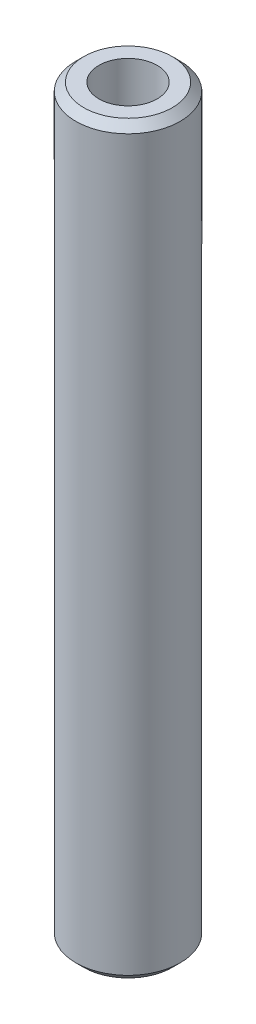
ISO-10303-21;
HEADER;
FILE_DESCRIPTION(('STEP AP214'),'2;1');
FILE_NAME('part.step','',(''),(''),'','','');
FILE_SCHEMA(('AUTOMOTIVE_DESIGN { 1 0 10303 214 1 1 1 1 }'));
ENDSEC;
DATA;
#1=APPLICATION_CONTEXT('core data for automotive mechanical design processes');
#2=APPLICATION_PROTOCOL_DEFINITION('international standard','automotive_design',2000,#1);
#3=PRODUCT_CONTEXT('',#1,'mechanical');
#4=PRODUCT('Part','Part','',(#3));
#5=PRODUCT_RELATED_PRODUCT_CATEGORY('part','',(#4));
#6=PRODUCT_DEFINITION_FORMATION('','',#4);
#7=PRODUCT_DEFINITION_CONTEXT('part definition',#1,'design');
#8=PRODUCT_DEFINITION('design','',#6,#7);
#9=PRODUCT_DEFINITION_SHAPE('','',#8);
#10=(LENGTH_UNIT() NAMED_UNIT(*) SI_UNIT(.MILLI.,.METRE.));
#11=(NAMED_UNIT(*) PLANE_ANGLE_UNIT() SI_UNIT($,.RADIAN.));
#12=(NAMED_UNIT(*) SI_UNIT($,.STERADIAN.) SOLID_ANGLE_UNIT());
#13=UNCERTAINTY_MEASURE_WITH_UNIT(LENGTH_MEASURE(1.E-05),#10,'distance_accuracy_value','');
#14=(GEOMETRIC_REPRESENTATION_CONTEXT(3) GLOBAL_UNCERTAINTY_ASSIGNED_CONTEXT((#13)) GLOBAL_UNIT_ASSIGNED_CONTEXT((#10,
#11,#12)) REPRESENTATION_CONTEXT('',''));
#15=CARTESIAN_POINT('',(0.,0.,0.));
#16=DIRECTION('',(0.,0.,1.));
#17=DIRECTION('',(1.,0.,0.));
#18=AXIS2_PLACEMENT_3D('',#15,#16,#17);
#19=CARTESIAN_POINT('',(0.,142.672714757315,0.));
#20=DIRECTION('',(0.,-1.,0.));
#21=DIRECTION('',(0.,0.,-1.));
#22=AXIS2_PLACEMENT_3D('',#19,#20,#21);
#23=CYLINDRICAL_SURFACE('',#22,10.);
#24=CARTESIAN_POINT('',(0.,141.158993646372,0.));
#25=DIRECTION('',(0.,1.,0.));
#26=DIRECTION('',(0.,0.,1.));
#27=AXIS2_PLACEMENT_3D('',#24,#25,#26);
#28=CIRCLE('',#27,10.);
#29=CARTESIAN_POINT('',(0.,141.158993646372,-10.));
#30=VERTEX_POINT('',#29);
#31=EDGE_CURVE('E50',#30,#30,#28,.F.);
#32=CARTESIAN_POINT('',(0.,1.513721110943,0.));
#33=DIRECTION('',(0.,1.,0.));
#34=DIRECTION('',(0.,0.,1.));
#35=AXIS2_PLACEMENT_3D('',#32,#33,#34);
#36=CIRCLE('',#35,10.);
#37=CARTESIAN_POINT('',(0.,1.51372111094297,-10.));
#38=VERTEX_POINT('',#37);
#39=EDGE_CURVE('E51',#38,#38,#36,.T.);
#40=CARTESIAN_POINT('',(0.,141.158993646372,-10.));
#41=CARTESIAN_POINT('',(0.,139.704355390794,-10.));
#42=CARTESIAN_POINT('',(0.,138.249717135217,-10.));
#43=CARTESIAN_POINT('',(0.,135.340440624062,-10.));
#44=CARTESIAN_POINT('',(0.,133.885802368485,-10.));
#45=CARTESIAN_POINT('',(0.,130.97652585733,-10.));
#46=CARTESIAN_POINT('',(0.,129.521887601753,-10.));
#47=CARTESIAN_POINT('',(0.,126.612611090598,-10.));
#48=CARTESIAN_POINT('',(0.,125.157972835021,-10.));
#49=CARTESIAN_POINT('',(0.,122.248696323866,-10.));
#50=CARTESIAN_POINT('',(0.,120.794058068288,-10.));
#51=CARTESIAN_POINT('',(0.,117.884781557134,-10.));
#52=CARTESIAN_POINT('',(0.,116.430143301556,-10.));
#53=CARTESIAN_POINT('',(0.,113.520866790401,-10.));
#54=CARTESIAN_POINT('',(0.,112.066228534824,-10.));
#55=CARTESIAN_POINT('',(0.,109.156952023669,-10.));
#56=CARTESIAN_POINT('',(0.,107.702313768092,-10.));
#57=CARTESIAN_POINT('',(0.,104.793037256937,-10.));
#58=CARTESIAN_POINT('',(0.,103.33839900136,-10.));
#59=CARTESIAN_POINT('',(0.,100.429122490205,-10.));
#60=CARTESIAN_POINT('',(0.,98.9744842346276,-10.));
#61=CARTESIAN_POINT('',(0.,96.0652077234729,-10.));
#62=CARTESIAN_POINT('',(0.,94.6105694678955,-10.));
#63=CARTESIAN_POINT('',(0.,91.7012929567407,-10.));
#64=CARTESIAN_POINT('',(0.,90.2466547011634,-10.));
#65=CARTESIAN_POINT('',(0.,87.3373781900086,-10.));
#66=CARTESIAN_POINT('',(0.,85.8827399344312,-10.));
#67=CARTESIAN_POINT('',(0.,82.9734634232764,-10.));
#68=CARTESIAN_POINT('',(0.,81.518825167699,-10.));
#69=CARTESIAN_POINT('',(0.,78.6095486565443,-10.));
#70=CARTESIAN_POINT('',(0.,77.1549104009669,-10.));
#71=CARTESIAN_POINT('',(0.,74.2456338898121,-10.));
#72=CARTESIAN_POINT('',(0.,72.7909956342347,-10.));
#73=CARTESIAN_POINT('',(0.,69.88171912308,-10.));
#74=CARTESIAN_POINT('',(0.,68.4270808675026,-10.));
#75=CARTESIAN_POINT('',(0.,65.5178043563478,-10.));
#76=CARTESIAN_POINT('',(0.,64.0631661007704,-10.));
#77=CARTESIAN_POINT('',(0.,61.1538895896157,-10.));
#78=CARTESIAN_POINT('',(0.,59.6992513340383,-10.));
#79=CARTESIAN_POINT('',(0.,56.7899748228835,-10.));
#80=CARTESIAN_POINT('',(0.,55.3353365673061,-10.));
#81=CARTESIAN_POINT('',(0.,52.4260600561514,-10.));
#82=CARTESIAN_POINT('',(0.,50.971421800574,-10.));
#83=CARTESIAN_POINT('',(0.,48.0621452894192,-10.));
#84=CARTESIAN_POINT('',(0.,46.6075070338418,-10.));
#85=CARTESIAN_POINT('',(0.,43.6982305226871,-10.));
#86=CARTESIAN_POINT('',(0.,42.2435922671097,-10.));
#87=CARTESIAN_POINT('',(0.,39.3343157559549,-10.));
#88=CARTESIAN_POINT('',(0.,37.8796775003775,-10.));
#89=CARTESIAN_POINT('',(0.,34.9704009892228,-10.));
#90=CARTESIAN_POINT('',(0.,33.5157627336454,-10.));
#91=CARTESIAN_POINT('',(0.,30.6064862224906,-10.));
#92=CARTESIAN_POINT('',(0.,29.1518479669132,-10.));
#93=CARTESIAN_POINT('',(0.,26.2425714557585,-10.));
#94=CARTESIAN_POINT('',(0.,24.7879332001811,-10.));
#95=CARTESIAN_POINT('',(0.,21.8786566890263,-10.));
#96=CARTESIAN_POINT('',(0.,20.4240184334489,-10.));
#97=CARTESIAN_POINT('',(0.,17.5147419222942,-10.));
#98=CARTESIAN_POINT('',(0.,16.0601036667168,-10.));
#99=CARTESIAN_POINT('',(0.,13.150827155562,-10.));
#100=CARTESIAN_POINT('',(0.,11.6961888999846,-10.));
#101=CARTESIAN_POINT('',(0.,8.78691238882988,-10.));
#102=CARTESIAN_POINT('',(0.,7.3322741332525,-10.));
#103=CARTESIAN_POINT('',(0.,4.42299762209774,-10.));
#104=CARTESIAN_POINT('',(0.,2.96835936652035,-10.));
#105=CARTESIAN_POINT('',(0.,1.51372111094297,-10.));
#106=B_SPLINE_CURVE_WITH_KNOTS('',3,(#40,#41,#42,#43,#44,#45,#46,#47,#48,#49,#50,#51,#52,#53,
#54,#55,#56,#57,#58,#59,#60,#61,#62,#63,#64,#65,#66,#67,#68,#69,#70,#71,#72,#73,#74,#75,#76,#77,
#78,#79,#80,#81,#82,#83,#84,#85,#86,#87,#88,#89,#90,#91,#92,#93,#94,#95,#96,#97,#98,#99,#100,
#101,#102,#103,#104,#105),.UNSPECIFIED.,.F.,.F.,(4,2,2,2,2,2,2,2,2,2,2,2,2,2,2,2,2,2,2,2,2,2,2,
2,2,2,2,2,2,2,2,2,4),(0.,4.36391476673215,8.72782953346429,13.0917443001964,17.4556590669286,
21.8195738336607,26.1834886003929,30.547403367125,34.9113181338572,39.2752329005893,
43.6391476673215,48.0030624340536,52.3669772007858,56.7308919675179,61.0948067342501,
65.4587215009822,69.8226362677144,74.1865510344465,78.5504658011787,82.9143805679108,
87.278295334643,91.6422101013751,96.0061248681073,100.370039634839,104.733954401572,
109.097869168304,113.461783935036,117.825698701768,122.1896134685,126.553528235232,
130.917443001964,135.281357768697,139.645272535429),.UNSPECIFIED.);
#107=EDGE_CURVE('BSEAM39',#30,#38,#106,.T.);
#108=ORIENTED_EDGE('',*,*,#31,.T.);
#109=ORIENTED_EDGE('',*,*,#39,.T.);
#110=ORIENTED_EDGE('',*,*,#107,.T.);
#111=ORIENTED_EDGE('',*,*,#107,.F.);
#112=EDGE_LOOP('',(#108,#110,#109,#111));
#113=FACE_BOUND('',#112,.T.);
#114=ADVANCED_FACE('F39',(#113),#23,.T.);
#115=CARTESIAN_POINT('',(0.,142.672714757315,0.));
#116=DIRECTION('',(0.,1.,0.));
#117=DIRECTION('',(0.,0.,1.));
#118=AXIS2_PLACEMENT_3D('',#115,#116,#117);
#119=PLANE('',#118);
#120=CARTESIAN_POINT('',(0.,142.672714757315,0.));
#121=DIRECTION('',(0.,1.,0.));
#122=DIRECTION('',(0.,0.,1.));
#123=AXIS2_PLACEMENT_3D('',#120,#121,#122);
#124=CIRCLE('',#123,8.48627888905698);
#125=CARTESIAN_POINT('',(0.,142.672714757315,-8.48627888905699));
#126=VERTEX_POINT('',#125);
#127=EDGE_CURVE('E54',#126,#126,#124,.T.);
#128=ORIENTED_EDGE('',*,*,#127,.T.);
#129=EDGE_LOOP('',(#128));
#130=FACE_BOUND('',#129,.T.);
#131=CARTESIAN_POINT('',(0.,142.672714757315,0.));
#132=DIRECTION('',(0.,1.,0.));
#133=DIRECTION('',(0.,0.,1.));
#134=AXIS2_PLACEMENT_3D('',#131,#132,#133);
#135=CIRCLE('',#134,5.5812899426975);
#136=CARTESIAN_POINT('',(0.,142.672714757315,5.5812899426975));
#137=VERTEX_POINT('',#136);
#138=EDGE_CURVE('E58',#137,#137,#135,.T.);
#139=ORIENTED_EDGE('',*,*,#138,.F.);
#140=EDGE_LOOP('',(#139));
#141=FACE_BOUND('',#140,.T.);
#142=ADVANCED_FACE('F69',(#130,#141),#119,.T.);
#143=CARTESIAN_POINT('',(0.,0.,0.));
#144=DIRECTION('',(0.,1.,0.));
#145=DIRECTION('',(0.,0.,1.));
#146=AXIS2_PLACEMENT_3D('',#143,#144,#145);
#147=PLANE('',#146);
#148=CARTESIAN_POINT('',(0.,0.,0.));
#149=DIRECTION('',(0.,1.,0.));
#150=DIRECTION('',(0.,0.,1.));
#151=AXIS2_PLACEMENT_3D('',#148,#149,#150);
#152=CIRCLE('',#151,8.48627888905699);
#153=CARTESIAN_POINT('',(0.,0.,8.48627888905699));
#154=VERTEX_POINT('',#153);
#155=EDGE_CURVE('E10',#154,#154,#152,.F.);
#156=ORIENTED_EDGE('',*,*,#155,.T.);
#157=EDGE_LOOP('',(#156));
#158=FACE_BOUND('',#157,.T.);
#159=CARTESIAN_POINT('',(0.,0.,0.));
#160=DIRECTION('',(0.,1.,0.));
#161=DIRECTION('',(0.,0.,1.));
#162=AXIS2_PLACEMENT_3D('',#159,#160,#161);
#163=CIRCLE('',#162,5.5812899426975);
#164=CARTESIAN_POINT('',(0.,0.,5.5812899426975));
#165=VERTEX_POINT('',#164);
#166=EDGE_CURVE('E63',#165,#165,#163,.T.);
#167=ORIENTED_EDGE('',*,*,#166,.T.);
#168=EDGE_LOOP('',(#167));
#169=FACE_BOUND('',#168,.T.);
#170=ADVANCED_FACE('F75',(#158,#169),#147,.F.);
#171=CARTESIAN_POINT('',(0.,142.672714757315,0.));
#172=DIRECTION('',(0.,-1.,0.));
#173=DIRECTION('',(0.,0.,-1.));
#174=AXIS2_PLACEMENT_3D('',#171,#172,#173);
#175=CYLINDRICAL_SURFACE('',#174,5.5812899426975);
#176=ORIENTED_EDGE('',*,*,#138,.T.);
#177=EDGE_LOOP('',(#176));
#178=FACE_BOUND('',#177,.T.);
#179=ORIENTED_EDGE('',*,*,#166,.F.);
#180=EDGE_LOOP('',(#179));
#181=FACE_BOUND('',#180,.T.);
#182=ADVANCED_FACE('F70',(#178,#181),#175,.F.);
#183=CARTESIAN_POINT('',(0.,142.672714757315,0.));
#184=DIRECTION('',(0.,-1.,0.));
#185=DIRECTION('',(0.,0.,-1.));
#186=AXIS2_PLACEMENT_3D('',#183,#184,#185);
#187=CONICAL_SURFACE('',#186,8.48627888905698,0.785398163397436);
#188=CARTESIAN_POINT('',(0.,141.158993646372,-10.));
#189=CARTESIAN_POINT('',(0.,141.174761574611,-9.98423207176102));
#190=CARTESIAN_POINT('',(0.,141.19052950285,-9.96846414352203));
#191=CARTESIAN_POINT('',(0.,141.222065359328,-9.93692828704406));
#192=CARTESIAN_POINT('',(0.,141.237833287567,-9.92116035880507));
#193=CARTESIAN_POINT('',(0.,141.269369144045,-9.88962450232709));
#194=CARTESIAN_POINT('',(0.,141.285137072284,-9.87385657408809));
#195=CARTESIAN_POINT('',(0.,141.316672928762,-9.84232071761011));
#196=CARTESIAN_POINT('',(0.,141.332440857001,-9.82655278937113));
#197=CARTESIAN_POINT('',(0.,141.363976713479,-9.79501693289315));
#198=CARTESIAN_POINT('',(0.,141.379744641718,-9.77924900465415));
#199=CARTESIAN_POINT('',(0.,141.411280498196,-9.74771314817617));
#200=CARTESIAN_POINT('',(0.,141.427048426435,-9.73194521993719));
#201=CARTESIAN_POINT('',(0.,141.458584282913,-9.70040936345921));
#202=CARTESIAN_POINT('',(0.,141.474352211152,-9.68464143522022));
#203=CARTESIAN_POINT('',(0.,141.50588806763,-9.65310557874224));
#204=CARTESIAN_POINT('',(0.,141.521655995869,-9.63733765050325));
#205=CARTESIAN_POINT('',(0.,141.553191852347,-9.60580179402527));
#206=CARTESIAN_POINT('',(0.,141.568959780586,-9.59003386578628));
#207=CARTESIAN_POINT('',(0.,141.600495637063,-9.5584980093083));
#208=CARTESIAN_POINT('',(0.,141.616263565302,-9.54273008106931));
#209=CARTESIAN_POINT('',(0.,141.64779942178,-9.51119422459133));
#210=CARTESIAN_POINT('',(0.,141.663567350019,-9.49542629635234));
#211=CARTESIAN_POINT('',(0.,141.695103206497,-9.46389043987436));
#212=CARTESIAN_POINT('',(0.,141.710871134736,-9.44812251163537));
#213=CARTESIAN_POINT('',(0.,141.742406991214,-9.4165866551574));
#214=CARTESIAN_POINT('',(0.,141.758174919453,-9.4008187269184));
#215=CARTESIAN_POINT('',(0.,141.789710775931,-9.36928287044042));
#216=CARTESIAN_POINT('',(0.,141.80547870417,-9.35351494220144));
#217=CARTESIAN_POINT('',(0.,141.837014560648,-9.32197908572346));
#218=CARTESIAN_POINT('',(0.,141.852782488887,-9.30621115748446));
#219=CARTESIAN_POINT('',(0.,141.884318345365,-9.27467530100648));
#220=CARTESIAN_POINT('',(0.,141.900086273604,-9.2589073727675));
#221=CARTESIAN_POINT('',(0.,141.931622130082,-9.22737151628952));
#222=CARTESIAN_POINT('',(0.,141.947390058321,-9.21160358805052));
#223=CARTESIAN_POINT('',(0.,141.978925914799,-9.18006773157254));
#224=CARTESIAN_POINT('',(0.,141.994693843038,-9.16429980333356));
#225=CARTESIAN_POINT('',(0.,142.026229699516,-9.13276394685558));
#226=CARTESIAN_POINT('',(0.,142.041997627755,-9.11699601861658));
#227=CARTESIAN_POINT('',(0.,142.073533484233,-9.0854601621386));
#228=CARTESIAN_POINT('',(0.,142.089301412472,-9.06969223389962));
#229=CARTESIAN_POINT('',(0.,142.12083726895,-9.03815637742164));
#230=CARTESIAN_POINT('',(0.,142.136605197189,-9.02238844918265));
#231=CARTESIAN_POINT('',(0.,142.168141053667,-8.99085259270467));
#232=CARTESIAN_POINT('',(0.,142.183908981906,-8.97508466446568));
#233=CARTESIAN_POINT('',(0.,142.215444838384,-8.9435488079877));
#234=CARTESIAN_POINT('',(0.,142.231212766623,-8.92778087974871));
#235=CARTESIAN_POINT('',(0.,142.262748623101,-8.89624502327073));
#236=CARTESIAN_POINT('',(0.,142.27851655134,-8.88047709503174));
#237=CARTESIAN_POINT('',(0.,142.310052407818,-8.84894123855376));
#238=CARTESIAN_POINT('',(0.,142.325820336057,-8.83317331031477));
#239=CARTESIAN_POINT('',(0.,142.357356192535,-8.80163745383679));
#240=CARTESIAN_POINT('',(0.,142.373124120774,-8.7858695255978));
#241=CARTESIAN_POINT('',(0.,142.404659977252,-8.75433366911982));
#242=CARTESIAN_POINT('',(0.,142.420427905491,-8.73856574088083));
#243=CARTESIAN_POINT('',(0.,142.451963761969,-8.70702988440285));
#244=CARTESIAN_POINT('',(0.,142.467731690208,-8.69126195616386));
#245=CARTESIAN_POINT('',(0.,142.499267546686,-8.65972609968588));
#246=CARTESIAN_POINT('',(0.,142.515035474925,-8.64395817144689));
#247=CARTESIAN_POINT('',(0.,142.546571331403,-8.61242231496891));
#248=CARTESIAN_POINT('',(0.,142.562339259642,-8.59665438672993));
#249=CARTESIAN_POINT('',(0.,142.59387511612,-8.56511853025195));
#250=CARTESIAN_POINT('',(0.,142.609643044359,-8.54935060201295));
#251=CARTESIAN_POINT('',(0.,142.641178900837,-8.51781474553497));
#252=CARTESIAN_POINT('',(0.,142.656946829076,-8.50204681729598));
#253=CARTESIAN_POINT('',(0.,142.672714757315,-8.48627888905699));
#254=B_SPLINE_CURVE_WITH_KNOTS('',3,(#188,#189,#190,#191,#192,#193,#194,#195,#196,#197,#198,
#199,#200,#201,#202,#203,#204,#205,#206,#207,#208,#209,#210,#211,#212,#213,#214,#215,#216,#217,
#218,#219,#220,#221,#222,#223,#224,#225,#226,#227,#228,#229,#230,#231,#232,#233,#234,#235,#236,
#237,#238,#239,#240,#241,#242,#243,#244,#245,#246,#247,#248,#249,#250,#251,#252,#253),
.UNSPECIFIED.,.F.,.F.,(4,2,2,2,2,2,2,2,2,2,2,2,2,2,2,2,2,2,2,2,2,2,2,2,2,2,2,2,2,2,2,2,4),(0.,
0.0668976538983058,0.133795307796632,0.200692961694938,0.267590615593264,0.334488269491571,
0.401385923389896,0.468283577288202,0.535181231186528,0.602078885084834,0.66897653898316,
0.735874192881467,0.802771846779792,0.869669500678098,0.936567154576424,1.00346480847473,
1.07036246237306,1.13726011627136,1.20415777016969,1.27105542406799,1.33795307796632,
1.40485073186463,1.47174838576295,1.53864603966126,1.60554369355958,1.67244134745789,
1.73933900135622,1.80623665525452,1.87313430915285,1.94003196305115,2.00692961694948,
2.07382727084779,2.14072492474611),.UNSPECIFIED.);
#255=EDGE_CURVE('BSEAM81',#30,#126,#254,.T.);
#256=ORIENTED_EDGE('',*,*,#31,.F.);
#257=ORIENTED_EDGE('',*,*,#127,.F.);
#258=ORIENTED_EDGE('',*,*,#255,.T.);
#259=ORIENTED_EDGE('',*,*,#255,.F.);
#260=EDGE_LOOP('',(#256,#258,#257,#259));
#261=FACE_BOUND('',#260,.T.);
#262=ADVANCED_FACE('F81',(#261),#187,.T.);
#263=CARTESIAN_POINT('',(0.,1.513721110943,0.));
#264=DIRECTION('',(0.,1.,0.));
#265=DIRECTION('',(0.,0.,1.));
#266=AXIS2_PLACEMENT_3D('',#263,#264,#265);
#267=CONICAL_SURFACE('',#266,10.,0.78539816339745);
#268=ORIENTED_EDGE('',*,*,#155,.F.);
#269=EDGE_LOOP('',(#268));
#270=FACE_BOUND('',#269,.T.);
#271=ORIENTED_EDGE('',*,*,#39,.F.);
#272=EDGE_LOOP('',(#271));
#273=FACE_BOUND('',#272,.T.);
#274=ADVANCED_FACE('F45',(#270,#273),#267,.T.);
#275=CLOSED_SHELL('',(#114,#142,#170,#182,#262,#274));
#276=MANIFOLD_SOLID_BREP('B2',#275);
#277=ADVANCED_BREP_SHAPE_REPRESENTATION('',(#18,#276),#14);
#278=SHAPE_DEFINITION_REPRESENTATION(#9,#277);
ENDSEC;
END-ISO-10303-21;
